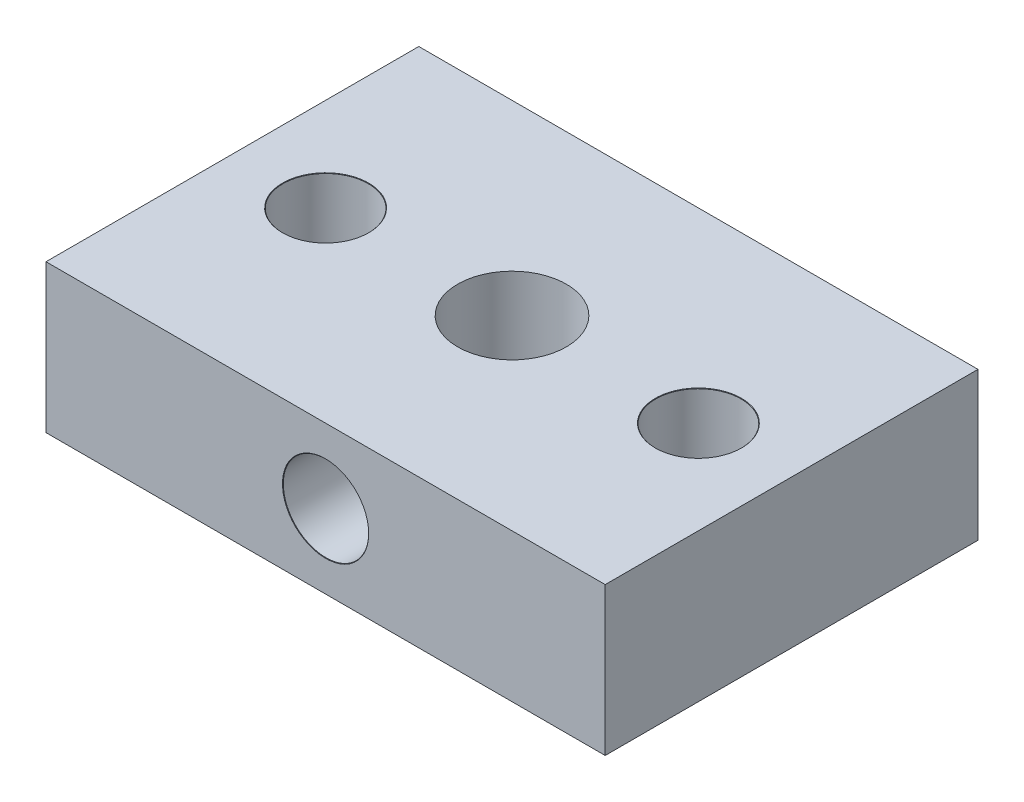
ISO-10303-21;
HEADER;
FILE_DESCRIPTION(('STEP AP214'),'2;1');
FILE_NAME('part.step','',(''),(''),'','','');
FILE_SCHEMA(('AUTOMOTIVE_DESIGN { 1 0 10303 214 1 1 1 1 }'));
ENDSEC;
DATA;
#1=APPLICATION_CONTEXT('core data for automotive mechanical design processes');
#2=APPLICATION_PROTOCOL_DEFINITION('international standard','automotive_design',2000,#1);
#3=PRODUCT_CONTEXT('',#1,'mechanical');
#4=PRODUCT('Part','Part','',(#3));
#5=PRODUCT_RELATED_PRODUCT_CATEGORY('part','',(#4));
#6=PRODUCT_DEFINITION_FORMATION('','',#4);
#7=PRODUCT_DEFINITION_CONTEXT('part definition',#1,'design');
#8=PRODUCT_DEFINITION('design','',#6,#7);
#9=PRODUCT_DEFINITION_SHAPE('','',#8);
#10=(LENGTH_UNIT() NAMED_UNIT(*) SI_UNIT(.MILLI.,.METRE.));
#11=(NAMED_UNIT(*) PLANE_ANGLE_UNIT() SI_UNIT($,.RADIAN.));
#12=(NAMED_UNIT(*) SI_UNIT($,.STERADIAN.) SOLID_ANGLE_UNIT());
#13=UNCERTAINTY_MEASURE_WITH_UNIT(LENGTH_MEASURE(1.E-05),#10,'distance_accuracy_value','');
#14=(GEOMETRIC_REPRESENTATION_CONTEXT(3) GLOBAL_UNCERTAINTY_ASSIGNED_CONTEXT((#13)) GLOBAL_UNIT_ASSIGNED_CONTEXT((#10,
#11,#12)) REPRESENTATION_CONTEXT('',''));
#15=CARTESIAN_POINT('',(0.,0.,0.));
#16=DIRECTION('',(0.,0.,1.));
#17=DIRECTION('',(1.,0.,0.));
#18=AXIS2_PLACEMENT_3D('',#15,#16,#17);
#19=CARTESIAN_POINT('',(0.,9.53,0.));
#20=DIRECTION('',(0.,-1.,0.));
#21=DIRECTION('',(0.,0.,-1.));
#22=AXIS2_PLACEMENT_3D('',#19,#20,#21);
#23=PLANE('',#22);
#24=CARTESIAN_POINT('',(12.,9.53,0.));
#25=DIRECTION('',(0.,1.,0.));
#26=DIRECTION('',(0.,0.,1.));
#27=AXIS2_PLACEMENT_3D('',#24,#25,#26);
#28=CIRCLE('',#27,2.775);
#29=CARTESIAN_POINT('',(12.,9.53,2.775));
#30=VERTEX_POINT('',#29);
#31=EDGE_CURVE('E267',#30,#30,#28,.T.);
#32=ORIENTED_EDGE('',*,*,#31,.F.);
#33=EDGE_LOOP('',(#32));
#34=FACE_BOUND('',#33,.T.);
#35=CARTESIAN_POINT('',(-12.,9.53,0.));
#36=DIRECTION('',(0.,1.,0.));
#37=DIRECTION('',(0.,0.,1.));
#38=AXIS2_PLACEMENT_3D('',#35,#36,#37);
#39=CIRCLE('',#38,2.775);
#40=CARTESIAN_POINT('',(-12.,9.53,2.775));
#41=VERTEX_POINT('',#40);
#42=EDGE_CURVE('E251',#41,#41,#39,.T.);
#43=ORIENTED_EDGE('',*,*,#42,.F.);
#44=EDGE_LOOP('',(#43));
#45=FACE_BOUND('',#44,.T.);
#46=DIRECTION('',(0.,0.,-1.));
#47=VECTOR('',#46,1.);
#48=CARTESIAN_POINT('',(18.,9.53,12.));
#49=LINE('',#48,#47);
#50=CARTESIAN_POINT('',(18.,9.53,12.));
#51=VERTEX_POINT('',#50);
#52=CARTESIAN_POINT('',(18.,9.53,-12.));
#53=VERTEX_POINT('',#52);
#54=EDGE_CURVE('E102',#51,#53,#49,.T.);
#55=ORIENTED_EDGE('',*,*,#54,.T.);
#56=DIRECTION('',(-1.,0.,0.));
#57=VECTOR('',#56,1.);
#58=CARTESIAN_POINT('',(-18.,9.53,-12.));
#59=LINE('',#58,#57);
#60=CARTESIAN_POINT('',(-18.,9.53,-12.));
#61=VERTEX_POINT('',#60);
#62=EDGE_CURVE('E97',#53,#61,#59,.T.);
#63=ORIENTED_EDGE('',*,*,#62,.T.);
#64=DIRECTION('',(0.,0.,1.));
#65=VECTOR('',#64,1.);
#66=CARTESIAN_POINT('',(-18.,9.53,12.));
#67=LINE('',#66,#65);
#68=CARTESIAN_POINT('',(-18.,9.53,12.));
#69=VERTEX_POINT('',#68);
#70=EDGE_CURVE('E100',#61,#69,#67,.T.);
#71=ORIENTED_EDGE('',*,*,#70,.T.);
#72=DIRECTION('',(1.,0.,0.));
#73=VECTOR('',#72,1.);
#74=CARTESIAN_POINT('',(-18.,9.53,12.));
#75=LINE('',#74,#73);
#76=EDGE_CURVE('E67',#69,#51,#75,.T.);
#77=ORIENTED_EDGE('',*,*,#76,.T.);
#78=EDGE_LOOP('',(#55,#63,#71,#77));
#79=FACE_BOUND('',#78,.T.);
#80=CARTESIAN_POINT('',(0.,9.53,0.));
#81=DIRECTION('',(0.,1.,0.));
#82=DIRECTION('',(0.,0.,1.));
#83=AXIS2_PLACEMENT_3D('',#80,#81,#82);
#84=CIRCLE('',#83,3.5);
#85=CARTESIAN_POINT('',(0.,9.53,3.5));
#86=VERTEX_POINT('',#85);
#87=EDGE_CURVE('E125',#86,#86,#84,.T.);
#88=ORIENTED_EDGE('',*,*,#87,.F.);
#89=EDGE_LOOP('',(#88));
#90=FACE_BOUND('',#89,.T.);
#91=ADVANCED_FACE('F47',(#34,#45,#79,#90),#23,.F.);
#92=CARTESIAN_POINT('',(0.,0.,0.));
#93=DIRECTION('',(0.,-1.,0.));
#94=DIRECTION('',(0.,0.,-1.));
#95=AXIS2_PLACEMENT_3D('',#92,#93,#94);
#96=PLANE('',#95);
#97=CARTESIAN_POINT('',(12.,0.,0.));
#98=DIRECTION('',(0.,-1.,0.));
#99=DIRECTION('',(0.,0.,-1.));
#100=AXIS2_PLACEMENT_3D('',#97,#98,#99);
#101=CIRCLE('',#100,2.74999999999999);
#102=CARTESIAN_POINT('',(12.,0.,-2.74999999999999));
#103=VERTEX_POINT('',#102);
#104=EDGE_CURVE('E51',#103,#103,#101,.T.);
#105=ORIENTED_EDGE('',*,*,#104,.F.);
#106=EDGE_LOOP('',(#105));
#107=FACE_BOUND('',#106,.T.);
#108=CARTESIAN_POINT('',(-12.,0.,0.));
#109=DIRECTION('',(0.,-1.,0.));
#110=DIRECTION('',(0.,0.,-1.));
#111=AXIS2_PLACEMENT_3D('',#108,#109,#110);
#112=CIRCLE('',#111,2.74999999999999);
#113=CARTESIAN_POINT('',(-12.,0.,-2.74999999999999));
#114=VERTEX_POINT('',#113);
#115=EDGE_CURVE('E146',#114,#114,#112,.T.);
#116=ORIENTED_EDGE('',*,*,#115,.F.);
#117=EDGE_LOOP('',(#116));
#118=FACE_BOUND('',#117,.T.);
#119=DIRECTION('',(0.,0.,-1.));
#120=VECTOR('',#119,1.);
#121=CARTESIAN_POINT('',(18.,0.,12.));
#122=LINE('',#121,#120);
#123=CARTESIAN_POINT('',(18.,0.,12.));
#124=VERTEX_POINT('',#123);
#125=CARTESIAN_POINT('',(18.,0.,-12.));
#126=VERTEX_POINT('',#125);
#127=EDGE_CURVE('E121',#124,#126,#122,.T.);
#128=ORIENTED_EDGE('',*,*,#127,.F.);
#129=DIRECTION('',(1.,0.,0.));
#130=VECTOR('',#129,1.);
#131=CARTESIAN_POINT('',(-18.,0.,12.));
#132=LINE('',#131,#130);
#133=CARTESIAN_POINT('',(-18.,0.,12.));
#134=VERTEX_POINT('',#133);
#135=EDGE_CURVE('E90',#134,#124,#132,.T.);
#136=ORIENTED_EDGE('',*,*,#135,.F.);
#137=DIRECTION('',(0.,0.,1.));
#138=VECTOR('',#137,1.);
#139=CARTESIAN_POINT('',(-18.,0.,12.));
#140=LINE('',#139,#138);
#141=CARTESIAN_POINT('',(-18.,0.,-12.));
#142=VERTEX_POINT('',#141);
#143=EDGE_CURVE('E84',#142,#134,#140,.T.);
#144=ORIENTED_EDGE('',*,*,#143,.F.);
#145=DIRECTION('',(-1.,0.,0.));
#146=VECTOR('',#145,1.);
#147=CARTESIAN_POINT('',(-18.,0.,-12.));
#148=LINE('',#147,#146);
#149=EDGE_CURVE('E107',#126,#142,#148,.T.);
#150=ORIENTED_EDGE('',*,*,#149,.F.);
#151=EDGE_LOOP('',(#128,#136,#144,#150));
#152=FACE_BOUND('',#151,.T.);
#153=CARTESIAN_POINT('',(0.,0.,0.));
#154=DIRECTION('',(0.,1.,0.));
#155=DIRECTION('',(0.,0.,1.));
#156=AXIS2_PLACEMENT_3D('',#153,#154,#155);
#157=CIRCLE('',#156,3.5);
#158=CARTESIAN_POINT('',(0.,0.,3.5));
#159=VERTEX_POINT('',#158);
#160=EDGE_CURVE('E144',#159,#159,#157,.T.);
#161=ORIENTED_EDGE('',*,*,#160,.T.);
#162=EDGE_LOOP('',(#161));
#163=FACE_BOUND('',#162,.T.);
#164=ADVANCED_FACE('F179',(#107,#118,#152,#163),#96,.T.);
#165=CARTESIAN_POINT('',(18.,9.53,12.));
#166=DIRECTION('',(-1.,0.,0.));
#167=DIRECTION('',(0.,0.,1.));
#168=AXIS2_PLACEMENT_3D('',#165,#166,#167);
#169=PLANE('',#168);
#170=ORIENTED_EDGE('',*,*,#127,.T.);
#171=DIRECTION('',(0.,-1.,0.));
#172=VECTOR('',#171,1.);
#173=CARTESIAN_POINT('',(18.,9.53,-12.));
#174=LINE('',#173,#172);
#175=EDGE_CURVE('E11',#53,#126,#174,.T.);
#176=ORIENTED_EDGE('',*,*,#175,.F.);
#177=ORIENTED_EDGE('',*,*,#54,.F.);
#178=DIRECTION('',(0.,-1.,0.));
#179=VECTOR('',#178,1.);
#180=CARTESIAN_POINT('',(18.,9.53,12.));
#181=LINE('',#180,#179);
#182=EDGE_CURVE('E117',#51,#124,#181,.T.);
#183=ORIENTED_EDGE('',*,*,#182,.T.);
#184=EDGE_LOOP('',(#170,#176,#177,#183));
#185=FACE_BOUND('',#184,.T.);
#186=ADVANCED_FACE('F49',(#185),#169,.F.);
#187=CARTESIAN_POINT('',(-18.,9.53,-12.));
#188=DIRECTION('',(0.,0.,1.));
#189=DIRECTION('',(1.,0.,0.));
#190=AXIS2_PLACEMENT_3D('',#187,#188,#189);
#191=PLANE('',#190);
#192=ORIENTED_EDGE('',*,*,#149,.T.);
#193=DIRECTION('',(0.,-1.,0.));
#194=VECTOR('',#193,1.);
#195=CARTESIAN_POINT('',(-18.,9.53,-12.));
#196=LINE('',#195,#194);
#197=EDGE_CURVE('E58',#61,#142,#196,.T.);
#198=ORIENTED_EDGE('',*,*,#197,.F.);
#199=ORIENTED_EDGE('',*,*,#62,.F.);
#200=ORIENTED_EDGE('',*,*,#175,.T.);
#201=EDGE_LOOP('',(#192,#198,#199,#200));
#202=FACE_BOUND('',#201,.T.);
#203=ADVANCED_FACE('F106',(#202),#191,.F.);
#204=CARTESIAN_POINT('',(-18.,9.53,12.));
#205=DIRECTION('',(1.,0.,0.));
#206=DIRECTION('',(0.,0.,-1.));
#207=AXIS2_PLACEMENT_3D('',#204,#205,#206);
#208=PLANE('',#207);
#209=ORIENTED_EDGE('',*,*,#143,.T.);
#210=DIRECTION('',(0.,-1.,0.));
#211=VECTOR('',#210,1.);
#212=CARTESIAN_POINT('',(-18.,9.53,12.));
#213=LINE('',#212,#211);
#214=EDGE_CURVE('E109',#69,#134,#213,.T.);
#215=ORIENTED_EDGE('',*,*,#214,.F.);
#216=ORIENTED_EDGE('',*,*,#70,.F.);
#217=ORIENTED_EDGE('',*,*,#197,.T.);
#218=EDGE_LOOP('',(#209,#215,#216,#217));
#219=FACE_BOUND('',#218,.T.);
#220=ADVANCED_FACE('F111',(#219),#208,.F.);
#221=CARTESIAN_POINT('',(-18.,9.53,12.));
#222=DIRECTION('',(0.,0.,-1.));
#223=DIRECTION('',(-1.,0.,0.));
#224=AXIS2_PLACEMENT_3D('',#221,#222,#223);
#225=PLANE('',#224);
#226=CARTESIAN_POINT('',(0.,4.765,12.));
#227=DIRECTION('',(0.,0.,1.));
#228=DIRECTION('',(1.,0.,0.));
#229=AXIS2_PLACEMENT_3D('',#226,#227,#228);
#230=CIRCLE('',#229,2.775);
#231=CARTESIAN_POINT('',(2.775,4.765,12.));
#232=VERTEX_POINT('',#231);
#233=EDGE_CURVE('E236',#232,#232,#230,.T.);
#234=ORIENTED_EDGE('',*,*,#233,.F.);
#235=EDGE_LOOP('',(#234));
#236=FACE_BOUND('',#235,.T.);
#237=ORIENTED_EDGE('',*,*,#135,.T.);
#238=ORIENTED_EDGE('',*,*,#182,.F.);
#239=ORIENTED_EDGE('',*,*,#76,.F.);
#240=ORIENTED_EDGE('',*,*,#214,.T.);
#241=EDGE_LOOP('',(#237,#238,#239,#240));
#242=FACE_BOUND('',#241,.T.);
#243=ADVANCED_FACE('F189',(#236,#242),#225,.F.);
#244=CARTESIAN_POINT('',(0.,9.53,0.));
#245=DIRECTION('',(0.,-1.,0.));
#246=DIRECTION('',(0.,0.,-1.));
#247=AXIS2_PLACEMENT_3D('',#244,#245,#246);
#248=CYLINDRICAL_SURFACE('',#247,3.5);
#249=CARTESIAN_POINT('',(2.75,4.765,2.1650635094611));
#250=CARTESIAN_POINT('',(2.74999421060021,4.65936644044173,2.16507653399448));
#251=CARTESIAN_POINT('',(2.74384483620532,4.55354178405285,2.17295093110774));
#252=CARTESIAN_POINT('',(2.71980787817357,4.3451900085924,2.2029488399375));
#253=CARTESIAN_POINT('',(2.70188108027469,4.24267511028146,2.22511994960115));
#254=CARTESIAN_POINT('',(2.64783035698246,4.00992356122777,2.28938054610227));
#255=CARTESIAN_POINT('',(2.60763555137901,3.88181765246939,2.33564359685731));
#256=CARTESIAN_POINT('',(2.51122430149724,3.63639849756006,2.43900547643055));
#257=CARTESIAN_POINT('',(2.45496488159261,3.51911533291815,2.49613323143862));
#258=CARTESIAN_POINT('',(2.34914275893423,3.33274768806701,2.5951702245577));
#259=CARTESIAN_POINT('',(2.30360920816236,3.26063851872782,2.63579709404205));
#260=CARTESIAN_POINT('',(2.20628490214582,3.12121041754635,2.71778629665323));
#261=CARTESIAN_POINT('',(2.15449206517827,3.05389309127583,2.75914887053965));
#262=CARTESIAN_POINT('',(1.98998253430014,2.85940760808828,2.88247718473637));
#263=CARTESIAN_POINT('',(1.86797759612949,2.73943001957169,2.96383888634129));
#264=CARTESIAN_POINT('',(1.62580894286708,2.54268224349117,3.10199120201574));
#265=CARTESIAN_POINT('',(1.50975371961843,2.46203689496531,3.16050538206092));
#266=CARTESIAN_POINT('',(1.2629782779793,2.31802021232819,3.26693248391722));
#267=CARTESIAN_POINT('',(1.1322808063371,2.25462259509817,3.31486151478893));
#268=CARTESIAN_POINT('',(0.880028118888101,2.15667219529318,3.38969740161407));
#269=CARTESIAN_POINT('',(0.760259433298403,2.11915337681478,3.41872339296452));
#270=CARTESIAN_POINT('',(0.514439564974251,2.06059966642217,3.4642369079187));
#271=CARTESIAN_POINT('',(0.388391782393318,2.03955595419613,3.48073114053615));
#272=CARTESIAN_POINT('',(0.133116545297402,2.01522448942815,3.49981534128643));
#273=CARTESIAN_POINT('',(0.00388028295283363,2.01199319650668,3.50236109709534));
#274=CARTESIAN_POINT('',(-0.253256643772846,2.02366321838175,3.49319545199566));
#275=CARTESIAN_POINT('',(-0.381157200217862,2.038565987299,3.48148290775305));
#276=CARTESIAN_POINT('',(-0.625521484331014,2.08434278715437,3.44575569132872));
#277=CARTESIAN_POINT('',(-0.742237972293574,2.11439009052687,3.42237839119146));
#278=CARTESIAN_POINT('',(-0.968471262142993,2.18842386703222,3.36536600019377));
#279=CARTESIAN_POINT('',(-1.07798630052667,2.23241373920921,3.33172840806289));
#280=CARTESIAN_POINT('',(-1.29870487770084,2.33759873954309,3.25245448815768));
#281=CARTESIAN_POINT('',(-1.40898203755629,2.40007452726148,3.2059546422473));
#282=CARTESIAN_POINT('',(-1.61776068256568,2.53766801755367,3.10584609413732));
#283=CARTESIAN_POINT('',(-1.71625457612567,2.61279379589633,3.05223285540503));
#284=CARTESIAN_POINT('',(-1.91986787709236,2.79055538899513,2.92932995450585));
#285=CARTESIAN_POINT('',(-2.0222323931581,2.89567610446693,2.85907487110502));
#286=CARTESIAN_POINT('',(-2.20889846684557,3.12041841719539,2.71744121125765));
#287=CARTESIAN_POINT('',(-2.29318134386281,3.24005481316569,2.64606155390615));
#288=CARTESIAN_POINT('',(-2.43293587882439,3.47672812699951,2.5176576371447));
#289=CARTESIAN_POINT('',(-2.49074065139936,3.59202988836803,2.45998121780893));
#290=CARTESIAN_POINT('',(-2.59068885257013,3.83343347036993,2.35448388691055));
#291=CARTESIAN_POINT('',(-2.63286683198284,3.95951069703534,2.30664133829956));
#292=CARTESIAN_POINT('',(-2.69023475396498,4.18631813887295,2.23920957596705));
#293=CARTESIAN_POINT('',(-2.70963496411836,4.28471845394547,2.21548067953326));
#294=CARTESIAN_POINT('',(-2.73758998210957,4.4851890905151,2.18085191804827));
#295=CARTESIAN_POINT('',(-2.74616616954523,4.58725176650774,2.16992676611514));
#296=CARTESIAN_POINT('',(-2.75178568462269,4.79266324183332,2.16280049158902));
#297=CARTESIAN_POINT('',(-2.74878130161344,4.89601560944614,2.16666028088721));
#298=CARTESIAN_POINT('',(-2.73141599089901,5.10028658913677,2.18850189441791));
#299=CARTESIAN_POINT('',(-2.71703825067085,5.20120137011668,2.20650462500528));
#300=CARTESIAN_POINT('',(-2.67230845744628,5.42689066761596,2.26059839817856));
#301=CARTESIAN_POINT('',(-2.63852369593237,5.55005497782221,2.30043035602118));
#302=CARTESIAN_POINT('',(-2.55616431502488,5.78693615943088,2.39160719200592));
#303=CARTESIAN_POINT('',(-2.50754428320863,5.90062263821762,2.44298729128824));
#304=CARTESIAN_POINT('',(-2.41364962463595,6.08563557726379,2.53520246357615));
#305=CARTESIAN_POINT('',(-2.37174011906209,6.15944532219352,2.57458237926902));
#306=CARTESIAN_POINT('',(-2.28168866192507,6.3023801475565,2.65471973379173));
#307=CARTESIAN_POINT('',(-2.2335442926995,6.37150339480547,2.69547770242839));
#308=CARTESIAN_POINT('',(-2.08003593314154,6.57172034416938,2.81789109127078));
#309=CARTESIAN_POINT('',(-1.96549546719253,6.69585904465633,2.89979129518596));
#310=CARTESIAN_POINT('',(-1.73215160762931,6.90576054098636,3.04393606529588));
#311=CARTESIAN_POINT('',(-1.61667150236581,6.99448877770326,3.10727214269809));
#312=CARTESIAN_POINT('',(-1.36950976180943,7.15424716567751,3.22381952814019));
#313=CARTESIAN_POINT('',(-1.23785590917642,7.22530704904124,3.27704780930102));
#314=CARTESIAN_POINT('',(-0.984645429245063,7.33571522769946,3.36080819718355));
#315=CARTESIAN_POINT('',(-0.865339549804108,7.37843413946376,3.39368041016449));
#316=CARTESIAN_POINT('',(-0.619375346147684,7.44737757519817,3.447052132668));
#317=CARTESIAN_POINT('',(-0.492721250413151,7.47361148450933,3.46755868201574));
#318=CARTESIAN_POINT('',(-0.234931953158334,7.50804156951243,3.49451866669702));
#319=CARTESIAN_POINT('',(-0.103780426395628,7.5161629155855,3.50091380147047));
#320=CARTESIAN_POINT('',(0.158217011939176,7.51356768315549,3.4988745281022));
#321=CARTESIAN_POINT('',(0.289062940265998,7.50285216288979,3.49044095302343));
#322=CARTESIAN_POINT('',(0.537617136652256,7.46467224742173,3.46057842340759));
#323=CARTESIAN_POINT('',(0.655619574646012,7.4383726442973,3.44005375738522));
#324=CARTESIAN_POINT('',(0.884986576677091,7.3714505243876,3.38830861533256));
#325=CARTESIAN_POINT('',(0.996349527478681,7.33082454308391,3.35708555218283));
#326=CARTESIAN_POINT('',(1.21931410171824,7.23315269372019,3.28301384971303));
#327=CARTESIAN_POINT('',(1.33019719035394,7.17503939118937,3.23942574336108));
#328=CARTESIAN_POINT('',(1.54078748792655,7.04617015410165,3.14473019134213));
#329=CARTESIAN_POINT('',(1.64048920526816,6.97540805110943,3.09361907909091));
#330=CARTESIAN_POINT('',(1.84661485995307,6.80790536909637,2.97602272322323));
#331=CARTESIAN_POINT('',(1.95050920407245,6.7087923488158,2.90849009426576));
#332=CARTESIAN_POINT('',(2.14121425214559,6.49650345390653,2.77110488979064));
#333=CARTESIAN_POINT('',(2.22800261909976,6.38330950270854,2.70124941831968));
#334=CARTESIAN_POINT('',(2.38003245389598,6.14936580821161,2.56809968010702));
#335=CARTESIAN_POINT('',(2.44611814998561,6.02925352870032,2.50465157196025));
#336=CARTESIAN_POINT('',(2.56089957665878,5.77665809865607,2.3871552073875));
#337=CARTESIAN_POINT('',(2.60962683387479,5.64419793252015,2.33309000217982));
#338=CARTESIAN_POINT('',(2.67565613227835,5.40815818970032,2.2566879729119));
#339=CARTESIAN_POINT('',(2.69798447563221,5.30752086205133,2.2296961702982));
#340=CARTESIAN_POINT('',(2.73124845776874,5.10192805568369,2.18883633793107));
#341=CARTESIAN_POINT('',(2.74222705996176,4.99699043622284,2.17491883502198));
#342=CARTESIAN_POINT('',(2.74805967592577,4.87043797981388,2.16752544873527));
#343=CARTESIAN_POINT('',(2.7487862738912,4.84937067844365,2.16660446152516));
#344=CARTESIAN_POINT('',(2.74975704676366,4.80720479694906,2.16537214968077));
#345=CARTESIAN_POINT('',(2.75000115675648,4.78610621299801,2.16506090708192));
#346=CARTESIAN_POINT('',(2.75,4.765,2.1650635094611));
#347=B_SPLINE_CURVE_WITH_KNOTS('',3,(#249,#250,#251,#252,#253,#254,#255,#256,#257,#258,#259,
#260,#261,#262,#263,#264,#265,#266,#267,#268,#269,#270,#271,#272,#273,#274,#275,#276,#277,#278,
#279,#280,#281,#282,#283,#284,#285,#286,#287,#288,#289,#290,#291,#292,#293,#294,#295,#296,#297,
#298,#299,#300,#301,#302,#303,#304,#305,#306,#307,#308,#309,#310,#311,#312,#313,#314,#315,#316,
#317,#318,#319,#320,#321,#322,#323,#324,#325,#326,#327,#328,#329,#330,#331,#332,#333,#334,#335,
#336,#337,#338,#339,#340,#341,#342,#343,#344,#345,#346),.UNSPECIFIED.,.T.,.F.,(4,2,2,2,2,2,2,2,
2,2,2,2,2,2,2,2,2,2,2,2,2,2,2,2,2,2,2,2,2,2,2,2,2,2,2,2,2,2,2,2,2,2,2,2,2,2,2,2,4),(0.,
0.316807910580575,0.634676051660908,1.05834967566017,1.48316749246629,1.76623682419432,
2.04940055997789,2.61467975906859,3.07187321737078,3.52836602423303,3.91318513269717,
4.29779807860371,4.68362942545055,5.06949171309426,5.43626189940034,5.80312156908768,
6.20666863202583,6.61047430346775,7.09674740813589,7.58352050017589,8.00614471870894,
8.42782885909679,8.73583054487902,9.04322290908238,9.3518830462554,9.66100031099542,
10.0601400150416,10.4605140008531,10.7408852966342,11.0213656379785,11.5815972922534,
12.0562592191988,12.530116900573,12.9212359317228,13.3121320863984,13.7046402076359,
14.0971262788422,14.4634341779337,14.8298307213231,15.2260535058067,15.6224700458881,
16.0967922273678,16.5717297344494,17.0235113195793,17.4744681384944,17.7929927176228,
18.1103070862888,18.1735986749592,18.2368987783366),.UNSPECIFIED.);
#348=CARTESIAN_POINT('',(2.75,4.765,2.1650635094611));
#349=VERTEX_POINT('',#348);
#350=EDGE_CURVE('E136',#349,#349,#347,.T.);
#351=ORIENTED_EDGE('',*,*,#350,.F.);
#352=EDGE_LOOP('',(#351));
#353=FACE_BOUND('',#352,.T.);
#354=ORIENTED_EDGE('',*,*,#87,.T.);
#355=EDGE_LOOP('',(#354));
#356=FACE_BOUND('',#355,.T.);
#357=ORIENTED_EDGE('',*,*,#160,.F.);
#358=EDGE_LOOP('',(#357));
#359=FACE_BOUND('',#358,.T.);
#360=ADVANCED_FACE('F147',(#353,#356,#359),#248,.F.);
#361=CARTESIAN_POINT('',(0.,4.765,12.));
#362=DIRECTION('',(0.,0.,1.));
#363=DIRECTION('',(1.,0.,0.));
#364=AXIS2_PLACEMENT_3D('',#361,#362,#363);
#365=CYLINDRICAL_SURFACE('',#364,2.75);
#366=ORIENTED_EDGE('',*,*,#350,.T.);
#367=EDGE_LOOP('',(#366));
#368=FACE_BOUND('',#367,.T.);
#369=CARTESIAN_POINT('',(0.,4.765,11.975));
#370=DIRECTION('',(0.,0.,1.));
#371=DIRECTION('',(1.,0.,0.));
#372=AXIS2_PLACEMENT_3D('',#369,#370,#371);
#373=CIRCLE('',#372,2.75);
#374=CARTESIAN_POINT('',(2.75,4.765,11.975));
#375=VERTEX_POINT('',#374);
#376=EDGE_CURVE('E145',#375,#375,#373,.T.);
#377=ORIENTED_EDGE('',*,*,#376,.T.);
#378=EDGE_LOOP('',(#377));
#379=FACE_BOUND('',#378,.T.);
#380=ADVANCED_FACE('F150',(#368,#379),#365,.F.);
#381=CARTESIAN_POINT('',(0.,4.765,12.));
#382=DIRECTION('',(0.,0.,1.));
#383=DIRECTION('',(1.,0.,0.));
#384=AXIS2_PLACEMENT_3D('',#381,#382,#383);
#385=CONICAL_SURFACE('',#384,2.775,0.785398163397448);
#386=ORIENTED_EDGE('',*,*,#376,.F.);
#387=EDGE_LOOP('',(#386));
#388=FACE_BOUND('',#387,.T.);
#389=ORIENTED_EDGE('',*,*,#233,.T.);
#390=EDGE_LOOP('',(#389));
#391=FACE_BOUND('',#390,.T.);
#392=ADVANCED_FACE('F154',(#388,#391),#385,.F.);
#393=CARTESIAN_POINT('',(-12.,9.53,0.));
#394=DIRECTION('',(0.,1.,0.));
#395=DIRECTION('',(0.,0.,1.));
#396=AXIS2_PLACEMENT_3D('',#393,#394,#395);
#397=CYLINDRICAL_SURFACE('',#396,2.74999999999999);
#398=ORIENTED_EDGE('',*,*,#115,.T.);
#399=EDGE_LOOP('',(#398));
#400=FACE_BOUND('',#399,.T.);
#401=CARTESIAN_POINT('',(-12.,9.50499999999999,0.));
#402=DIRECTION('',(0.,1.,0.));
#403=DIRECTION('',(0.,0.,1.));
#404=AXIS2_PLACEMENT_3D('',#401,#402,#403);
#405=CIRCLE('',#404,2.74999999999999);
#406=CARTESIAN_POINT('',(-12.,9.50499999999999,2.74999999999999));
#407=VERTEX_POINT('',#406);
#408=EDGE_CURVE('E246',#407,#407,#405,.T.);
#409=ORIENTED_EDGE('',*,*,#408,.T.);
#410=EDGE_LOOP('',(#409));
#411=FACE_BOUND('',#410,.T.);
#412=ADVANCED_FACE('F158',(#400,#411),#397,.F.);
#413=CARTESIAN_POINT('',(-12.,9.53,0.));
#414=DIRECTION('',(0.,1.,0.));
#415=DIRECTION('',(0.,0.,1.));
#416=AXIS2_PLACEMENT_3D('',#413,#414,#415);
#417=CONICAL_SURFACE('',#416,2.775,0.785398163397379);
#418=ORIENTED_EDGE('',*,*,#408,.F.);
#419=EDGE_LOOP('',(#418));
#420=FACE_BOUND('',#419,.T.);
#421=ORIENTED_EDGE('',*,*,#42,.T.);
#422=EDGE_LOOP('',(#421));
#423=FACE_BOUND('',#422,.T.);
#424=ADVANCED_FACE('F162',(#420,#423),#417,.F.);
#425=CARTESIAN_POINT('',(12.,9.53,0.));
#426=DIRECTION('',(0.,1.,0.));
#427=DIRECTION('',(0.,0.,1.));
#428=AXIS2_PLACEMENT_3D('',#425,#426,#427);
#429=CYLINDRICAL_SURFACE('',#428,2.74999999999999);
#430=ORIENTED_EDGE('',*,*,#104,.T.);
#431=EDGE_LOOP('',(#430));
#432=FACE_BOUND('',#431,.T.);
#433=CARTESIAN_POINT('',(12.,9.50499999999999,0.));
#434=DIRECTION('',(0.,1.,0.));
#435=DIRECTION('',(0.,0.,1.));
#436=AXIS2_PLACEMENT_3D('',#433,#434,#435);
#437=CIRCLE('',#436,2.74999999999999);
#438=CARTESIAN_POINT('',(12.,9.50499999999999,2.74999999999999));
#439=VERTEX_POINT('',#438);
#440=EDGE_CURVE('E262',#439,#439,#437,.T.);
#441=ORIENTED_EDGE('',*,*,#440,.T.);
#442=EDGE_LOOP('',(#441));
#443=FACE_BOUND('',#442,.T.);
#444=ADVANCED_FACE('F166',(#432,#443),#429,.F.);
#445=CARTESIAN_POINT('',(12.,9.53,0.));
#446=DIRECTION('',(0.,1.,0.));
#447=DIRECTION('',(0.,0.,1.));
#448=AXIS2_PLACEMENT_3D('',#445,#446,#447);
#449=CONICAL_SURFACE('',#448,2.775,0.785398163397379);
#450=ORIENTED_EDGE('',*,*,#440,.F.);
#451=EDGE_LOOP('',(#450));
#452=FACE_BOUND('',#451,.T.);
#453=ORIENTED_EDGE('',*,*,#31,.T.);
#454=EDGE_LOOP('',(#453));
#455=FACE_BOUND('',#454,.T.);
#456=ADVANCED_FACE('F170',(#452,#455),#449,.F.);
#457=CLOSED_SHELL('',(#91,#164,#186,#203,#220,#243,#360,#380,#392,#412,#424,#444,#456));
#458=MANIFOLD_SOLID_BREP('B2',#457);
#459=ADVANCED_BREP_SHAPE_REPRESENTATION('',(#18,#458),#14);
#460=SHAPE_DEFINITION_REPRESENTATION(#9,#459);
ENDSEC;
END-ISO-10303-21;
